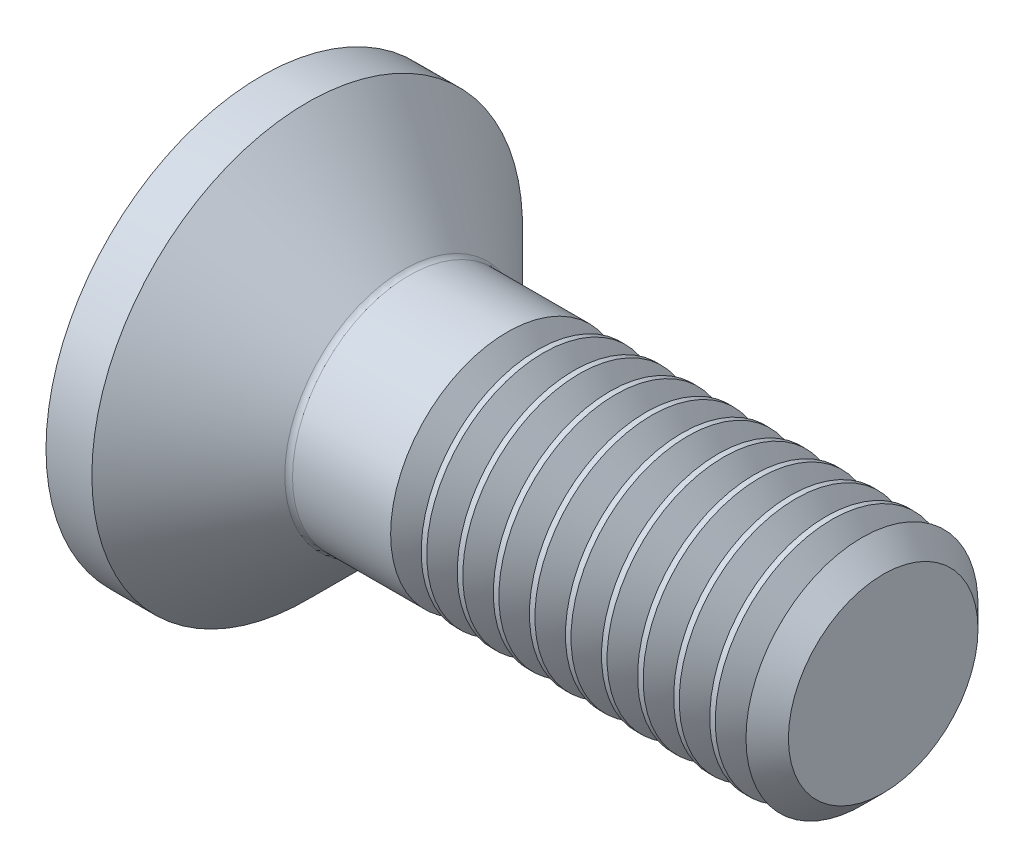
ISO-10303-21;
HEADER;
FILE_DESCRIPTION(('STEP AP214'),'2;1');
FILE_NAME('part.step','',(''),(''),'','','');
FILE_SCHEMA(('AUTOMOTIVE_DESIGN { 1 0 10303 214 1 1 1 1 }'));
ENDSEC;
DATA;
#1=APPLICATION_CONTEXT('core data for automotive mechanical design processes');
#2=APPLICATION_PROTOCOL_DEFINITION('international standard','automotive_design',2000,#1);
#3=PRODUCT_CONTEXT('',#1,'mechanical');
#4=PRODUCT('Part','Part','',(#3));
#5=PRODUCT_RELATED_PRODUCT_CATEGORY('part','',(#4));
#6=PRODUCT_DEFINITION_FORMATION('','',#4);
#7=PRODUCT_DEFINITION_CONTEXT('part definition',#1,'design');
#8=PRODUCT_DEFINITION('design','',#6,#7);
#9=PRODUCT_DEFINITION_SHAPE('','',#8);
#10=(LENGTH_UNIT() NAMED_UNIT(*) SI_UNIT(.MILLI.,.METRE.));
#11=(NAMED_UNIT(*) PLANE_ANGLE_UNIT() SI_UNIT($,.RADIAN.));
#12=(NAMED_UNIT(*) SI_UNIT($,.STERADIAN.) SOLID_ANGLE_UNIT());
#13=UNCERTAINTY_MEASURE_WITH_UNIT(LENGTH_MEASURE(1.E-05),#10,'distance_accuracy_value','');
#14=(GEOMETRIC_REPRESENTATION_CONTEXT(3) GLOBAL_UNCERTAINTY_ASSIGNED_CONTEXT((#13)) GLOBAL_UNIT_ASSIGNED_CONTEXT((#10,
#11,#12)) REPRESENTATION_CONTEXT('',''));
#15=CARTESIAN_POINT('',(0.,0.,0.));
#16=DIRECTION('',(0.,0.,1.));
#17=DIRECTION('',(1.,0.,0.));
#18=AXIS2_PLACEMENT_3D('',#15,#16,#17);
#19=CARTESIAN_POINT('',(0.,0.,0.));
#20=DIRECTION('',(-1.,0.,0.));
#21=DIRECTION('',(0.,0.,1.));
#22=AXIS2_PLACEMENT_3D('',#19,#20,#21);
#23=PLANE('',#22);
#24=CARTESIAN_POINT('',(0.,0.,0.));
#25=DIRECTION('',(-1.,0.,0.));
#26=DIRECTION('',(0.,0.,1.));
#27=AXIS2_PLACEMENT_3D('',#24,#25,#26);
#28=CIRCLE('',#27,2.77);
#29=CARTESIAN_POINT('',(0.,0.,2.77));
#30=VERTEX_POINT('',#29);
#31=EDGE_CURVE('E151',#30,#30,#28,.T.);
#32=ORIENTED_EDGE('',*,*,#31,.T.);
#33=EDGE_LOOP('',(#32));
#34=FACE_BOUND('',#33,.T.);
#35=DIRECTION('',(0.,-0.499999999999998,-0.86602540378444));
#36=VECTOR('',#35,1.);
#37=CARTESIAN_POINT('',(0.,-0.577350269189626,1.));
#38=LINE('',#37,#36);
#39=CARTESIAN_POINT('',(0.,-0.577350269189626,1.));
#40=VERTEX_POINT('',#39);
#41=CARTESIAN_POINT('',(0.,-1.15470053837925,0.));
#42=VERTEX_POINT('',#41);
#43=EDGE_CURVE('E120',#40,#42,#38,.T.);
#44=ORIENTED_EDGE('',*,*,#43,.T.);
#45=DIRECTION('',(0.,0.499999999999999,-0.866025403784439));
#46=VECTOR('',#45,1.);
#47=CARTESIAN_POINT('',(0.,-1.15470053837925,0.));
#48=LINE('',#47,#46);
#49=CARTESIAN_POINT('',(0.,-0.577350269189625,-1.));
#50=VERTEX_POINT('',#49);
#51=EDGE_CURVE('E51',#42,#50,#48,.T.);
#52=ORIENTED_EDGE('',*,*,#51,.T.);
#53=DIRECTION('',(0.,1.,0.));
#54=VECTOR('',#53,1.);
#55=CARTESIAN_POINT('',(0.,-0.577350269189625,-1.));
#56=LINE('',#55,#54);
#57=CARTESIAN_POINT('',(0.,0.577350269189626,-1.));
#58=VERTEX_POINT('',#57);
#59=EDGE_CURVE('E131',#50,#58,#56,.T.);
#60=ORIENTED_EDGE('',*,*,#59,.T.);
#61=DIRECTION('',(0.,0.5,0.866025403784439));
#62=VECTOR('',#61,1.);
#63=CARTESIAN_POINT('',(0.,0.577350269189626,-1.));
#64=LINE('',#63,#62);
#65=CARTESIAN_POINT('',(0.,1.15470053837925,0.));
#66=VERTEX_POINT('',#65);
#67=EDGE_CURVE('E416',#58,#66,#64,.T.);
#68=ORIENTED_EDGE('',*,*,#67,.T.);
#69=DIRECTION('',(0.,-0.499999999999999,0.866025403784439));
#70=VECTOR('',#69,1.);
#71=CARTESIAN_POINT('',(0.,1.15470053837925,0.));
#72=LINE('',#71,#70);
#73=CARTESIAN_POINT('',(0.,0.577350269189626,0.999999999999999));
#74=VERTEX_POINT('',#73);
#75=EDGE_CURVE('E419',#66,#74,#72,.T.);
#76=ORIENTED_EDGE('',*,*,#75,.T.);
#77=DIRECTION('',(0.,-1.,0.));
#78=VECTOR('',#77,1.);
#79=CARTESIAN_POINT('',(0.,0.577350269189626,0.999999999999999));
#80=LINE('',#79,#78);
#81=EDGE_CURVE('E422',#74,#40,#80,.T.);
#82=ORIENTED_EDGE('',*,*,#81,.T.);
#83=EDGE_LOOP('',(#44,#52,#60,#68,#76,#82));
#84=FACE_BOUND('',#83,.T.);
#85=ADVANCED_FACE('F35',(#34,#84),#23,.T.);
#86=CARTESIAN_POINT('',(0.,0.,0.));
#87=DIRECTION('',(-1.,0.,0.));
#88=DIRECTION('',(0.,0.,1.));
#89=AXIS2_PLACEMENT_3D('',#86,#87,#88);
#90=CYLINDRICAL_SURFACE('',#89,2.77);
#91=CARTESIAN_POINT('',(0.590000000000013,0.,0.));
#92=DIRECTION('',(-1.,0.,0.));
#93=DIRECTION('',(0.,0.,1.));
#94=AXIS2_PLACEMENT_3D('',#91,#92,#93);
#95=CIRCLE('',#94,2.77);
#96=CARTESIAN_POINT('',(0.590000000000013,0.,2.77));
#97=VERTEX_POINT('',#96);
#98=EDGE_CURVE('E148',#97,#97,#95,.T.);
#99=ORIENTED_EDGE('',*,*,#98,.T.);
#100=EDGE_LOOP('',(#99));
#101=FACE_BOUND('',#100,.T.);
#102=ORIENTED_EDGE('',*,*,#31,.F.);
#103=EDGE_LOOP('',(#102));
#104=FACE_BOUND('',#103,.T.);
#105=ADVANCED_FACE('F174',(#101,#104),#90,.T.);
#106=CARTESIAN_POINT('',(0.590000000000013,0.,0.));
#107=DIRECTION('',(-1.,0.,0.));
#108=DIRECTION('',(0.,0.,1.));
#109=AXIS2_PLACEMENT_3D('',#106,#107,#108);
#110=CONICAL_SURFACE('',#109,2.77,0.785398163397451);
#111=CARTESIAN_POINT('',(1.83071067811866,0.,0.));
#112=DIRECTION('',(-1.,0.,0.));
#113=DIRECTION('',(0.,0.,1.));
#114=AXIS2_PLACEMENT_3D('',#111,#112,#113);
#115=CIRCLE('',#114,1.52928932188135);
#116=CARTESIAN_POINT('',(1.83071067811866,0.,1.52928932188135));
#117=VERTEX_POINT('',#116);
#118=EDGE_CURVE('E44',#117,#117,#115,.T.);
#119=ORIENTED_EDGE('',*,*,#118,.T.);
#120=EDGE_LOOP('',(#119));
#121=FACE_BOUND('',#120,.T.);
#122=ORIENTED_EDGE('',*,*,#98,.F.);
#123=EDGE_LOOP('',(#122));
#124=FACE_BOUND('',#123,.T.);
#125=ADVANCED_FACE('F157',(#121,#124),#110,.T.);
#126=CARTESIAN_POINT('',(0.,0.,0.));
#127=DIRECTION('',(-1.,0.,0.));
#128=DIRECTION('',(0.,0.,1.));
#129=AXIS2_PLACEMENT_3D('',#126,#127,#128);
#130=CYLINDRICAL_SURFACE('',#129,1.5);
#131=CARTESIAN_POINT('',(3.16359278553217,0.,0.));
#132=DIRECTION('',(-1.,0.,0.));
#133=DIRECTION('',(0.,-1.,0.));
#134=AXIS2_PLACEMENT_3D('',#131,#132,#133);
#135=CIRCLE('',#134,1.5);
#136=CARTESIAN_POINT('',(3.16359278553217,-1.5,0.));
#137=VERTEX_POINT('',#136);
#138=EDGE_CURVE('E392',#137,#137,#135,.T.);
#139=ORIENTED_EDGE('',*,*,#138,.T.);
#140=EDGE_LOOP('',(#139));
#141=FACE_BOUND('',#140,.T.);
#142=CARTESIAN_POINT('',(1.90142135623731,0.,0.));
#143=DIRECTION('',(-1.,0.,0.));
#144=DIRECTION('',(0.,0.,1.));
#145=AXIS2_PLACEMENT_3D('',#142,#143,#144);
#146=CIRCLE('',#145,1.5);
#147=CARTESIAN_POINT('',(1.90142135623731,0.,1.5));
#148=VERTEX_POINT('',#147);
#149=EDGE_CURVE('E11',#148,#148,#146,.F.);
#150=ORIENTED_EDGE('',*,*,#149,.T.);
#151=EDGE_LOOP('',(#150));
#152=FACE_BOUND('',#151,.T.);
#153=ADVANCED_FACE('F161',(#141,#152),#130,.T.);
#154=CARTESIAN_POINT('',(1.90142135623731,0.,0.));
#155=DIRECTION('',(-1.,0.,0.));
#156=DIRECTION('',(0.,0.,1.));
#157=AXIS2_PLACEMENT_3D('',#154,#155,#156);
#158=TOROIDAL_SURFACE('',#157,1.6,0.1);
#159=ORIENTED_EDGE('',*,*,#149,.F.);
#160=EDGE_LOOP('',(#159));
#161=FACE_BOUND('',#160,.T.);
#162=ORIENTED_EDGE('',*,*,#118,.F.);
#163=EDGE_LOOP('',(#162));
#164=FACE_BOUND('',#163,.T.);
#165=ADVANCED_FACE('F37',(#161,#164),#158,.F.);
#166=CARTESIAN_POINT('',(1.1,-1.15470053837925,0.));
#167=DIRECTION('',(0.,0.866025403784439,0.499999999999999));
#168=DIRECTION('',(0.,-0.499999999999999,0.866025403784439));
#169=AXIS2_PLACEMENT_3D('',#166,#167,#168);
#170=PLANE('',#169);
#171=ORIENTED_EDGE('',*,*,#51,.F.);
#172=DIRECTION('',(-1.,0.,0.));
#173=VECTOR('',#172,1.);
#174=CARTESIAN_POINT('',(1.1,-1.15470053837925,0.));
#175=LINE('',#174,#173);
#176=CARTESIAN_POINT('',(1.1,-1.15470053837925,0.));
#177=VERTEX_POINT('',#176);
#178=EDGE_CURVE('E413',#177,#42,#175,.T.);
#179=ORIENTED_EDGE('',*,*,#178,.F.);
#180=DIRECTION('',(0.,0.499999999999999,-0.866025403784439));
#181=VECTOR('',#180,1.);
#182=CARTESIAN_POINT('',(1.1,-1.15470053837925,0.));
#183=LINE('',#182,#181);
#184=CARTESIAN_POINT('',(1.1,-0.866025403784438,-0.499999999999998));
#185=VERTEX_POINT('',#184);
#186=EDGE_CURVE('E116',#177,#185,#183,.T.);
#187=ORIENTED_EDGE('',*,*,#186,.T.);
#188=CARTESIAN_POINT('',(1.1,-0.577350269189625,-1.));
#189=VERTEX_POINT('',#188);
#190=EDGE_CURVE('E112',#185,#189,#183,.T.);
#191=ORIENTED_EDGE('',*,*,#190,.T.);
#192=DIRECTION('',(-1.,0.,0.));
#193=VECTOR('',#192,1.);
#194=CARTESIAN_POINT('',(1.1,-0.577350269189625,-1.));
#195=LINE('',#194,#193);
#196=EDGE_CURVE('E114',#189,#50,#195,.T.);
#197=ORIENTED_EDGE('',*,*,#196,.T.);
#198=EDGE_LOOP('',(#171,#179,#187,#191,#197));
#199=FACE_BOUND('',#198,.T.);
#200=ADVANCED_FACE('F113',(#199),#170,.T.);
#201=CARTESIAN_POINT('',(1.1,-0.577350269189625,-1.));
#202=DIRECTION('',(0.,0.,1.));
#203=DIRECTION('',(1.,0.,0.));
#204=AXIS2_PLACEMENT_3D('',#201,#202,#203);
#205=PLANE('',#204);
#206=ORIENTED_EDGE('',*,*,#59,.F.);
#207=ORIENTED_EDGE('',*,*,#196,.F.);
#208=DIRECTION('',(0.,1.,0.));
#209=VECTOR('',#208,1.);
#210=CARTESIAN_POINT('',(1.1,-0.577350269189625,-1.));
#211=LINE('',#210,#209);
#212=CARTESIAN_POINT('',(1.1,0.,-1.));
#213=VERTEX_POINT('',#212);
#214=EDGE_CURVE('E59',#189,#213,#211,.T.);
#215=ORIENTED_EDGE('',*,*,#214,.T.);
#216=CARTESIAN_POINT('',(1.1,0.577350269189626,-1.));
#217=VERTEX_POINT('',#216);
#218=EDGE_CURVE('E126',#213,#217,#211,.T.);
#219=ORIENTED_EDGE('',*,*,#218,.T.);
#220=DIRECTION('',(-1.,0.,0.));
#221=VECTOR('',#220,1.);
#222=CARTESIAN_POINT('',(1.1,0.577350269189626,-1.));
#223=LINE('',#222,#221);
#224=EDGE_CURVE('E133',#217,#58,#223,.T.);
#225=ORIENTED_EDGE('',*,*,#224,.T.);
#226=EDGE_LOOP('',(#206,#207,#215,#219,#225));
#227=FACE_BOUND('',#226,.T.);
#228=ADVANCED_FACE('F128',(#227),#205,.T.);
#229=CARTESIAN_POINT('',(1.1,0.577350269189626,-1.));
#230=DIRECTION('',(0.,-0.866025403784438,0.5));
#231=DIRECTION('',(0.,-0.5,-0.866025403784439));
#232=AXIS2_PLACEMENT_3D('',#229,#230,#231);
#233=PLANE('',#232);
#234=ORIENTED_EDGE('',*,*,#67,.F.);
#235=ORIENTED_EDGE('',*,*,#224,.F.);
#236=DIRECTION('',(0.,0.5,0.866025403784439));
#237=VECTOR('',#236,1.);
#238=CARTESIAN_POINT('',(1.1,0.577350269189626,-1.));
#239=LINE('',#238,#237);
#240=CARTESIAN_POINT('',(1.1,0.866025403784439,-0.5));
#241=VERTEX_POINT('',#240);
#242=EDGE_CURVE('E398',#217,#241,#239,.T.);
#243=ORIENTED_EDGE('',*,*,#242,.T.);
#244=CARTESIAN_POINT('',(1.1,1.15470053837925,0.));
#245=VERTEX_POINT('',#244);
#246=EDGE_CURVE('E125',#241,#245,#239,.T.);
#247=ORIENTED_EDGE('',*,*,#246,.T.);
#248=DIRECTION('',(-1.,0.,0.));
#249=VECTOR('',#248,1.);
#250=CARTESIAN_POINT('',(1.1,1.15470053837925,0.));
#251=LINE('',#250,#249);
#252=EDGE_CURVE('E139',#245,#66,#251,.T.);
#253=ORIENTED_EDGE('',*,*,#252,.T.);
#254=EDGE_LOOP('',(#234,#235,#243,#247,#253));
#255=FACE_BOUND('',#254,.T.);
#256=ADVANCED_FACE('F202',(#255),#233,.T.);
#257=CARTESIAN_POINT('',(1.1,1.15470053837925,0.));
#258=DIRECTION('',(0.,-0.866025403784439,-0.499999999999999));
#259=DIRECTION('',(0.,0.499999999999999,-0.866025403784439));
#260=AXIS2_PLACEMENT_3D('',#257,#258,#259);
#261=PLANE('',#260);
#262=ORIENTED_EDGE('',*,*,#75,.F.);
#263=ORIENTED_EDGE('',*,*,#252,.F.);
#264=DIRECTION('',(0.,-0.499999999999999,0.866025403784439));
#265=VECTOR('',#264,1.);
#266=CARTESIAN_POINT('',(1.1,1.15470053837925,0.));
#267=LINE('',#266,#265);
#268=CARTESIAN_POINT('',(1.1,0.866025403784438,0.499999999999999));
#269=VERTEX_POINT('',#268);
#270=EDGE_CURVE('E402',#245,#269,#267,.T.);
#271=ORIENTED_EDGE('',*,*,#270,.T.);
#272=CARTESIAN_POINT('',(1.1,0.577350269189626,0.999999999999999));
#273=VERTEX_POINT('',#272);
#274=EDGE_CURVE('E401',#269,#273,#267,.T.);
#275=ORIENTED_EDGE('',*,*,#274,.T.);
#276=DIRECTION('',(-1.,0.,0.));
#277=VECTOR('',#276,1.);
#278=CARTESIAN_POINT('',(1.1,0.577350269189626,0.999999999999999));
#279=LINE('',#278,#277);
#280=EDGE_CURVE('E431',#273,#74,#279,.T.);
#281=ORIENTED_EDGE('',*,*,#280,.T.);
#282=EDGE_LOOP('',(#262,#263,#271,#275,#281));
#283=FACE_BOUND('',#282,.T.);
#284=ADVANCED_FACE('F205',(#283),#261,.T.);
#285=CARTESIAN_POINT('',(1.1,0.577350269189626,0.999999999999999));
#286=DIRECTION('',(0.,0.,-1.));
#287=DIRECTION('',(0.,1.,0.));
#288=AXIS2_PLACEMENT_3D('',#285,#286,#287);
#289=PLANE('',#288);
#290=ORIENTED_EDGE('',*,*,#81,.F.);
#291=ORIENTED_EDGE('',*,*,#280,.F.);
#292=DIRECTION('',(0.,-1.,0.));
#293=VECTOR('',#292,1.);
#294=CARTESIAN_POINT('',(1.1,0.577350269189626,0.999999999999999));
#295=LINE('',#294,#293);
#296=CARTESIAN_POINT('',(1.1,0.,1.));
#297=VERTEX_POINT('',#296);
#298=EDGE_CURVE('E406',#273,#297,#295,.T.);
#299=ORIENTED_EDGE('',*,*,#298,.T.);
#300=CARTESIAN_POINT('',(1.1,-0.577350269189626,1.));
#301=VERTEX_POINT('',#300);
#302=EDGE_CURVE('E405',#297,#301,#295,.T.);
#303=ORIENTED_EDGE('',*,*,#302,.T.);
#304=DIRECTION('',(-1.,0.,0.));
#305=VECTOR('',#304,1.);
#306=CARTESIAN_POINT('',(1.1,-0.577350269189626,1.));
#307=LINE('',#306,#305);
#308=EDGE_CURVE('E428',#301,#40,#307,.T.);
#309=ORIENTED_EDGE('',*,*,#308,.T.);
#310=EDGE_LOOP('',(#290,#291,#299,#303,#309));
#311=FACE_BOUND('',#310,.T.);
#312=ADVANCED_FACE('F209',(#311),#289,.T.);
#313=CARTESIAN_POINT('',(1.1,-0.577350269189626,1.));
#314=DIRECTION('',(0.,0.86602540378444,-0.499999999999998));
#315=DIRECTION('',(0.,0.499999999999998,0.86602540378444));
#316=AXIS2_PLACEMENT_3D('',#313,#314,#315);
#317=PLANE('',#316);
#318=ORIENTED_EDGE('',*,*,#43,.F.);
#319=ORIENTED_EDGE('',*,*,#308,.F.);
#320=DIRECTION('',(0.,-0.499999999999998,-0.86602540378444));
#321=VECTOR('',#320,1.);
#322=CARTESIAN_POINT('',(1.1,-0.577350269189626,1.));
#323=LINE('',#322,#321);
#324=CARTESIAN_POINT('',(1.1,-0.866025403784439,0.499999999999997));
#325=VERTEX_POINT('',#324);
#326=EDGE_CURVE('E410',#301,#325,#323,.T.);
#327=ORIENTED_EDGE('',*,*,#326,.T.);
#328=EDGE_CURVE('E409',#325,#177,#323,.T.);
#329=ORIENTED_EDGE('',*,*,#328,.T.);
#330=ORIENTED_EDGE('',*,*,#178,.T.);
#331=EDGE_LOOP('',(#318,#319,#327,#329,#330));
#332=FACE_BOUND('',#331,.T.);
#333=ADVANCED_FACE('F213',(#332),#317,.T.);
#334=CARTESIAN_POINT('',(1.1,-0.577350269189626,-1.));
#335=DIRECTION('',(1.,0.,0.));
#336=DIRECTION('',(0.,0.,-1.));
#337=AXIS2_PLACEMENT_3D('',#334,#335,#336);
#338=PLANE('',#337);
#339=ORIENTED_EDGE('',*,*,#214,.F.);
#340=ORIENTED_EDGE('',*,*,#190,.F.);
#341=CARTESIAN_POINT('',(1.1,0.,0.));
#342=DIRECTION('',(-1.,0.,0.));
#343=DIRECTION('',(0.,0.,1.));
#344=AXIS2_PLACEMENT_3D('',#341,#342,#343);
#345=CIRCLE('',#344,1.);
#346=EDGE_CURVE('E123',#213,#185,#345,.T.);
#347=ORIENTED_EDGE('',*,*,#346,.F.);
#348=EDGE_LOOP('',(#339,#340,#347));
#349=FACE_BOUND('',#348,.T.);
#350=ADVANCED_FACE('F122',(#349),#338,.F.);
#351=ORIENTED_EDGE('',*,*,#186,.F.);
#352=ORIENTED_EDGE('',*,*,#328,.F.);
#353=EDGE_CURVE('E136',#185,#325,#345,.T.);
#354=ORIENTED_EDGE('',*,*,#353,.F.);
#355=EDGE_LOOP('',(#351,#352,#354));
#356=FACE_BOUND('',#355,.T.);
#357=ADVANCED_FACE('F220',(#356),#338,.F.);
#358=ORIENTED_EDGE('',*,*,#326,.F.);
#359=ORIENTED_EDGE('',*,*,#302,.F.);
#360=EDGE_CURVE('E132',#325,#297,#345,.T.);
#361=ORIENTED_EDGE('',*,*,#360,.F.);
#362=EDGE_LOOP('',(#358,#359,#361));
#363=FACE_BOUND('',#362,.T.);
#364=ADVANCED_FACE('F444',(#363),#338,.F.);
#365=ORIENTED_EDGE('',*,*,#298,.F.);
#366=ORIENTED_EDGE('',*,*,#274,.F.);
#367=EDGE_CURVE('E138',#297,#269,#345,.T.);
#368=ORIENTED_EDGE('',*,*,#367,.F.);
#369=EDGE_LOOP('',(#365,#366,#368));
#370=FACE_BOUND('',#369,.T.);
#371=ADVANCED_FACE('F455',(#370),#338,.F.);
#372=ORIENTED_EDGE('',*,*,#270,.F.);
#373=ORIENTED_EDGE('',*,*,#246,.F.);
#374=EDGE_CURVE('E145',#269,#241,#345,.T.);
#375=ORIENTED_EDGE('',*,*,#374,.F.);
#376=EDGE_LOOP('',(#372,#373,#375));
#377=FACE_BOUND('',#376,.T.);
#378=ADVANCED_FACE('F453',(#377),#338,.F.);
#379=ORIENTED_EDGE('',*,*,#242,.F.);
#380=ORIENTED_EDGE('',*,*,#218,.F.);
#381=EDGE_CURVE('E449',#241,#213,#345,.T.);
#382=ORIENTED_EDGE('',*,*,#381,.F.);
#383=EDGE_LOOP('',(#379,#380,#382));
#384=FACE_BOUND('',#383,.T.);
#385=ADVANCED_FACE('F197',(#384),#338,.F.);
#386=CARTESIAN_POINT('',(1.1,0.,0.));
#387=DIRECTION('',(-1.,0.,0.));
#388=DIRECTION('',(0.,0.,1.));
#389=AXIS2_PLACEMENT_3D('',#386,#387,#388);
#390=CONICAL_SURFACE('',#389,1.,1.04719755119659);
#391=CARTESIAN_POINT('',(1.67735026918963,0.,0.));
#392=VERTEX_POINT('',#391);
#393=VERTEX_LOOP('',#392);
#394=FACE_BOUND('',#393,.T.);
#395=ORIENTED_EDGE('',*,*,#367,.T.);
#396=ORIENTED_EDGE('',*,*,#374,.T.);
#397=ORIENTED_EDGE('',*,*,#381,.T.);
#398=ORIENTED_EDGE('',*,*,#346,.T.);
#399=ORIENTED_EDGE('',*,*,#353,.T.);
#400=ORIENTED_EDGE('',*,*,#360,.T.);
#401=EDGE_LOOP('',(#395,#396,#397,#398,#399,#400));
#402=FACE_BOUND('',#401,.T.);
#403=ADVANCED_FACE('F194',(#394,#402),#390,.F.);
#404=CARTESIAN_POINT('',(3.55640921446782,0.,0.));
#405=DIRECTION('',(1.,0.,0.));
#406=DIRECTION('',(0.,1.,0.));
#407=AXIS2_PLACEMENT_3D('',#404,#405,#406);
#408=CONICAL_SURFACE('',#407,1.5,0.959931088596882);
#409=CARTESIAN_POINT('',(3.360001,0.,0.));
#410=DIRECTION('',(-1.,0.,0.));
#411=DIRECTION('',(0.,-1.,0.));
#412=AXIS2_PLACEMENT_3D('',#409,#410,#411);
#413=CIRCLE('',#412,1.2195);
#414=CARTESIAN_POINT('',(3.360001,-1.2195,0.));
#415=VERTEX_POINT('',#414);
#416=EDGE_CURVE('E389',#415,#415,#413,.T.);
#417=ORIENTED_EDGE('',*,*,#416,.F.);
#418=EDGE_LOOP('',(#417));
#419=FACE_BOUND('',#418,.T.);
#420=CARTESIAN_POINT('',(3.55640921446782,0.,0.));
#421=DIRECTION('',(-1.,0.,0.));
#422=DIRECTION('',(0.,-1.,0.));
#423=AXIS2_PLACEMENT_3D('',#420,#421,#422);
#424=CIRCLE('',#423,1.5);
#425=CARTESIAN_POINT('',(3.55640921446782,-1.5,0.));
#426=VERTEX_POINT('',#425);
#427=EDGE_CURVE('E395',#426,#426,#424,.T.);
#428=ORIENTED_EDGE('',*,*,#427,.T.);
#429=EDGE_LOOP('',(#428));
#430=FACE_BOUND('',#429,.T.);
#431=ADVANCED_FACE('F196',(#419,#430),#408,.T.);
#432=CARTESIAN_POINT('',(3.360001,0.,0.));
#433=DIRECTION('',(-1.,0.,0.));
#434=DIRECTION('',(0.,-1.,0.));
#435=AXIS2_PLACEMENT_3D('',#432,#433,#434);
#436=CONICAL_SURFACE('',#435,1.2195,0.959931088596878);
#437=ORIENTED_EDGE('',*,*,#138,.F.);
#438=EDGE_LOOP('',(#437));
#439=FACE_BOUND('',#438,.T.);
#440=ORIENTED_EDGE('',*,*,#416,.T.);
#441=EDGE_LOOP('',(#440));
#442=FACE_BOUND('',#441,.T.);
#443=ADVANCED_FACE('F223',(#439,#442),#436,.T.);
#444=CARTESIAN_POINT('',(3.62759278553217,0.,0.));
#445=DIRECTION('',(-1.,0.,0.));
#446=DIRECTION('',(0.,-1.,0.));
#447=AXIS2_PLACEMENT_3D('',#444,#445,#446);
#448=CIRCLE('',#447,1.5);
#449=CARTESIAN_POINT('',(3.62759278553217,-1.5,0.));
#450=VERTEX_POINT('',#449);
#451=EDGE_CURVE('E383',#450,#450,#448,.T.);
#452=ORIENTED_EDGE('',*,*,#451,.T.);
#453=EDGE_LOOP('',(#452));
#454=FACE_BOUND('',#453,.T.);
#455=ORIENTED_EDGE('',*,*,#427,.F.);
#456=EDGE_LOOP('',(#455));
#457=FACE_BOUND('',#456,.T.);
#458=ADVANCED_FACE('F171',(#454,#457),#130,.T.);
#459=CARTESIAN_POINT('',(4.02040921446782,0.,0.));
#460=DIRECTION('',(1.,0.,0.));
#461=DIRECTION('',(0.,1.,0.));
#462=AXIS2_PLACEMENT_3D('',#459,#460,#461);
#463=CONICAL_SURFACE('',#462,1.5,0.959931088596882);
#464=CARTESIAN_POINT('',(3.824001,0.,0.));
#465=DIRECTION('',(-1.,0.,0.));
#466=DIRECTION('',(0.,-1.,0.));
#467=AXIS2_PLACEMENT_3D('',#464,#465,#466);
#468=CIRCLE('',#467,1.2195);
#469=CARTESIAN_POINT('',(3.824001,-1.2195,0.));
#470=VERTEX_POINT('',#469);
#471=EDGE_CURVE('E380',#470,#470,#468,.T.);
#472=ORIENTED_EDGE('',*,*,#471,.F.);
#473=EDGE_LOOP('',(#472));
#474=FACE_BOUND('',#473,.T.);
#475=CARTESIAN_POINT('',(4.02040921446782,0.,0.));
#476=DIRECTION('',(-1.,0.,0.));
#477=DIRECTION('',(0.,-1.,0.));
#478=AXIS2_PLACEMENT_3D('',#475,#476,#477);
#479=CIRCLE('',#478,1.5);
#480=CARTESIAN_POINT('',(4.02040921446782,-1.5,0.));
#481=VERTEX_POINT('',#480);
#482=EDGE_CURVE('E386',#481,#481,#479,.T.);
#483=ORIENTED_EDGE('',*,*,#482,.T.);
#484=EDGE_LOOP('',(#483));
#485=FACE_BOUND('',#484,.T.);
#486=ADVANCED_FACE('F228',(#474,#485),#463,.T.);
#487=CARTESIAN_POINT('',(3.824001,0.,0.));
#488=DIRECTION('',(-1.,0.,0.));
#489=DIRECTION('',(0.,-1.,0.));
#490=AXIS2_PLACEMENT_3D('',#487,#488,#489);
#491=CONICAL_SURFACE('',#490,1.2195,0.959931088596878);
#492=ORIENTED_EDGE('',*,*,#451,.F.);
#493=EDGE_LOOP('',(#492));
#494=FACE_BOUND('',#493,.T.);
#495=ORIENTED_EDGE('',*,*,#471,.T.);
#496=EDGE_LOOP('',(#495));
#497=FACE_BOUND('',#496,.T.);
#498=ADVANCED_FACE('F231',(#494,#497),#491,.T.);
#499=CARTESIAN_POINT('',(4.09159278553217,0.,0.));
#500=DIRECTION('',(-1.,0.,0.));
#501=DIRECTION('',(0.,-1.,0.));
#502=AXIS2_PLACEMENT_3D('',#499,#500,#501);
#503=CIRCLE('',#502,1.5);
#504=CARTESIAN_POINT('',(4.09159278553217,-1.5,0.));
#505=VERTEX_POINT('',#504);
#506=EDGE_CURVE('E374',#505,#505,#503,.T.);
#507=ORIENTED_EDGE('',*,*,#506,.T.);
#508=EDGE_LOOP('',(#507));
#509=FACE_BOUND('',#508,.T.);
#510=ORIENTED_EDGE('',*,*,#482,.F.);
#511=EDGE_LOOP('',(#510));
#512=FACE_BOUND('',#511,.T.);
#513=ADVANCED_FACE('F235',(#509,#512),#130,.T.);
#514=CARTESIAN_POINT('',(4.48440921446782,0.,0.));
#515=DIRECTION('',(1.,0.,0.));
#516=DIRECTION('',(0.,1.,0.));
#517=AXIS2_PLACEMENT_3D('',#514,#515,#516);
#518=CONICAL_SURFACE('',#517,1.5,0.959931088596882);
#519=CARTESIAN_POINT('',(4.288001,0.,0.));
#520=DIRECTION('',(-1.,0.,0.));
#521=DIRECTION('',(0.,-1.,0.));
#522=AXIS2_PLACEMENT_3D('',#519,#520,#521);
#523=CIRCLE('',#522,1.2195);
#524=CARTESIAN_POINT('',(4.288001,-1.2195,0.));
#525=VERTEX_POINT('',#524);
#526=EDGE_CURVE('E371',#525,#525,#523,.T.);
#527=ORIENTED_EDGE('',*,*,#526,.F.);
#528=EDGE_LOOP('',(#527));
#529=FACE_BOUND('',#528,.T.);
#530=CARTESIAN_POINT('',(4.48440921446782,0.,0.));
#531=DIRECTION('',(-1.,0.,0.));
#532=DIRECTION('',(0.,-1.,0.));
#533=AXIS2_PLACEMENT_3D('',#530,#531,#532);
#534=CIRCLE('',#533,1.5);
#535=CARTESIAN_POINT('',(4.48440921446782,-1.5,0.));
#536=VERTEX_POINT('',#535);
#537=EDGE_CURVE('E377',#536,#536,#534,.T.);
#538=ORIENTED_EDGE('',*,*,#537,.T.);
#539=EDGE_LOOP('',(#538));
#540=FACE_BOUND('',#539,.T.);
#541=ADVANCED_FACE('F237',(#529,#540),#518,.T.);
#542=CARTESIAN_POINT('',(4.288001,0.,0.));
#543=DIRECTION('',(-1.,0.,0.));
#544=DIRECTION('',(0.,-1.,0.));
#545=AXIS2_PLACEMENT_3D('',#542,#543,#544);
#546=CONICAL_SURFACE('',#545,1.2195,0.959931088596878);
#547=ORIENTED_EDGE('',*,*,#506,.F.);
#548=EDGE_LOOP('',(#547));
#549=FACE_BOUND('',#548,.T.);
#550=ORIENTED_EDGE('',*,*,#526,.T.);
#551=EDGE_LOOP('',(#550));
#552=FACE_BOUND('',#551,.T.);
#553=ADVANCED_FACE('F240',(#549,#552),#546,.T.);
#554=CARTESIAN_POINT('',(4.55559278553217,0.,0.));
#555=DIRECTION('',(-1.,0.,0.));
#556=DIRECTION('',(0.,-1.,0.));
#557=AXIS2_PLACEMENT_3D('',#554,#555,#556);
#558=CIRCLE('',#557,1.5);
#559=CARTESIAN_POINT('',(4.55559278553217,-1.5,0.));
#560=VERTEX_POINT('',#559);
#561=EDGE_CURVE('E365',#560,#560,#558,.T.);
#562=ORIENTED_EDGE('',*,*,#561,.T.);
#563=EDGE_LOOP('',(#562));
#564=FACE_BOUND('',#563,.T.);
#565=ORIENTED_EDGE('',*,*,#537,.F.);
#566=EDGE_LOOP('',(#565));
#567=FACE_BOUND('',#566,.T.);
#568=ADVANCED_FACE('F244',(#564,#567),#130,.T.);
#569=CARTESIAN_POINT('',(4.94840921446782,0.,0.));
#570=DIRECTION('',(1.,0.,0.));
#571=DIRECTION('',(0.,1.,0.));
#572=AXIS2_PLACEMENT_3D('',#569,#570,#571);
#573=CONICAL_SURFACE('',#572,1.5,0.959931088596882);
#574=CARTESIAN_POINT('',(4.752001,0.,0.));
#575=DIRECTION('',(-1.,0.,0.));
#576=DIRECTION('',(0.,-1.,0.));
#577=AXIS2_PLACEMENT_3D('',#574,#575,#576);
#578=CIRCLE('',#577,1.2195);
#579=CARTESIAN_POINT('',(4.752001,-1.2195,0.));
#580=VERTEX_POINT('',#579);
#581=EDGE_CURVE('E362',#580,#580,#578,.T.);
#582=ORIENTED_EDGE('',*,*,#581,.F.);
#583=EDGE_LOOP('',(#582));
#584=FACE_BOUND('',#583,.T.);
#585=CARTESIAN_POINT('',(4.94840921446782,0.,0.));
#586=DIRECTION('',(-1.,0.,0.));
#587=DIRECTION('',(0.,-1.,0.));
#588=AXIS2_PLACEMENT_3D('',#585,#586,#587);
#589=CIRCLE('',#588,1.5);
#590=CARTESIAN_POINT('',(4.94840921446782,-1.5,0.));
#591=VERTEX_POINT('',#590);
#592=EDGE_CURVE('E368',#591,#591,#589,.T.);
#593=ORIENTED_EDGE('',*,*,#592,.T.);
#594=EDGE_LOOP('',(#593));
#595=FACE_BOUND('',#594,.T.);
#596=ADVANCED_FACE('F246',(#584,#595),#573,.T.);
#597=CARTESIAN_POINT('',(4.752001,0.,0.));
#598=DIRECTION('',(-1.,0.,0.));
#599=DIRECTION('',(0.,-1.,0.));
#600=AXIS2_PLACEMENT_3D('',#597,#598,#599);
#601=CONICAL_SURFACE('',#600,1.2195,0.959931088596878);
#602=ORIENTED_EDGE('',*,*,#561,.F.);
#603=EDGE_LOOP('',(#602));
#604=FACE_BOUND('',#603,.T.);
#605=ORIENTED_EDGE('',*,*,#581,.T.);
#606=EDGE_LOOP('',(#605));
#607=FACE_BOUND('',#606,.T.);
#608=ADVANCED_FACE('F249',(#604,#607),#601,.T.);
#609=CARTESIAN_POINT('',(5.01959278553217,0.,0.));
#610=DIRECTION('',(-1.,0.,0.));
#611=DIRECTION('',(0.,-1.,0.));
#612=AXIS2_PLACEMENT_3D('',#609,#610,#611);
#613=CIRCLE('',#612,1.5);
#614=CARTESIAN_POINT('',(5.01959278553217,-1.5,0.));
#615=VERTEX_POINT('',#614);
#616=EDGE_CURVE('E356',#615,#615,#613,.T.);
#617=ORIENTED_EDGE('',*,*,#616,.T.);
#618=EDGE_LOOP('',(#617));
#619=FACE_BOUND('',#618,.T.);
#620=ORIENTED_EDGE('',*,*,#592,.F.);
#621=EDGE_LOOP('',(#620));
#622=FACE_BOUND('',#621,.T.);
#623=ADVANCED_FACE('F253',(#619,#622),#130,.T.);
#624=CARTESIAN_POINT('',(5.41240921446782,0.,0.));
#625=DIRECTION('',(1.,0.,0.));
#626=DIRECTION('',(0.,1.,0.));
#627=AXIS2_PLACEMENT_3D('',#624,#625,#626);
#628=CONICAL_SURFACE('',#627,1.5,0.959931088596882);
#629=CARTESIAN_POINT('',(5.216001,0.,0.));
#630=DIRECTION('',(-1.,0.,0.));
#631=DIRECTION('',(0.,-1.,0.));
#632=AXIS2_PLACEMENT_3D('',#629,#630,#631);
#633=CIRCLE('',#632,1.2195);
#634=CARTESIAN_POINT('',(5.216001,-1.2195,0.));
#635=VERTEX_POINT('',#634);
#636=EDGE_CURVE('E353',#635,#635,#633,.T.);
#637=ORIENTED_EDGE('',*,*,#636,.F.);
#638=EDGE_LOOP('',(#637));
#639=FACE_BOUND('',#638,.T.);
#640=CARTESIAN_POINT('',(5.41240921446782,0.,0.));
#641=DIRECTION('',(-1.,0.,0.));
#642=DIRECTION('',(0.,-1.,0.));
#643=AXIS2_PLACEMENT_3D('',#640,#641,#642);
#644=CIRCLE('',#643,1.5);
#645=CARTESIAN_POINT('',(5.41240921446782,-1.5,0.));
#646=VERTEX_POINT('',#645);
#647=EDGE_CURVE('E359',#646,#646,#644,.T.);
#648=ORIENTED_EDGE('',*,*,#647,.T.);
#649=EDGE_LOOP('',(#648));
#650=FACE_BOUND('',#649,.T.);
#651=ADVANCED_FACE('F255',(#639,#650),#628,.T.);
#652=CARTESIAN_POINT('',(5.216001,0.,0.));
#653=DIRECTION('',(-1.,0.,0.));
#654=DIRECTION('',(0.,-1.,0.));
#655=AXIS2_PLACEMENT_3D('',#652,#653,#654);
#656=CONICAL_SURFACE('',#655,1.2195,0.959931088596878);
#657=ORIENTED_EDGE('',*,*,#616,.F.);
#658=EDGE_LOOP('',(#657));
#659=FACE_BOUND('',#658,.T.);
#660=ORIENTED_EDGE('',*,*,#636,.T.);
#661=EDGE_LOOP('',(#660));
#662=FACE_BOUND('',#661,.T.);
#663=ADVANCED_FACE('F258',(#659,#662),#656,.T.);
#664=CARTESIAN_POINT('',(5.48359278553217,0.,0.));
#665=DIRECTION('',(-1.,0.,0.));
#666=DIRECTION('',(0.,-1.,0.));
#667=AXIS2_PLACEMENT_3D('',#664,#665,#666);
#668=CIRCLE('',#667,1.5);
#669=CARTESIAN_POINT('',(5.48359278553217,-1.5,0.));
#670=VERTEX_POINT('',#669);
#671=EDGE_CURVE('E347',#670,#670,#668,.T.);
#672=ORIENTED_EDGE('',*,*,#671,.T.);
#673=EDGE_LOOP('',(#672));
#674=FACE_BOUND('',#673,.T.);
#675=ORIENTED_EDGE('',*,*,#647,.F.);
#676=EDGE_LOOP('',(#675));
#677=FACE_BOUND('',#676,.T.);
#678=ADVANCED_FACE('F262',(#674,#677),#130,.T.);
#679=CARTESIAN_POINT('',(5.87640921446782,0.,0.));
#680=DIRECTION('',(1.,0.,0.));
#681=DIRECTION('',(0.,1.,0.));
#682=AXIS2_PLACEMENT_3D('',#679,#680,#681);
#683=CONICAL_SURFACE('',#682,1.5,0.959931088596882);
#684=CARTESIAN_POINT('',(5.680001,0.,0.));
#685=DIRECTION('',(-1.,0.,0.));
#686=DIRECTION('',(0.,-1.,0.));
#687=AXIS2_PLACEMENT_3D('',#684,#685,#686);
#688=CIRCLE('',#687,1.2195);
#689=CARTESIAN_POINT('',(5.680001,-1.2195,0.));
#690=VERTEX_POINT('',#689);
#691=EDGE_CURVE('E344',#690,#690,#688,.T.);
#692=ORIENTED_EDGE('',*,*,#691,.F.);
#693=EDGE_LOOP('',(#692));
#694=FACE_BOUND('',#693,.T.);
#695=CARTESIAN_POINT('',(5.87640921446782,0.,0.));
#696=DIRECTION('',(-1.,0.,0.));
#697=DIRECTION('',(0.,-1.,0.));
#698=AXIS2_PLACEMENT_3D('',#695,#696,#697);
#699=CIRCLE('',#698,1.5);
#700=CARTESIAN_POINT('',(5.87640921446782,-1.5,0.));
#701=VERTEX_POINT('',#700);
#702=EDGE_CURVE('E350',#701,#701,#699,.T.);
#703=ORIENTED_EDGE('',*,*,#702,.T.);
#704=EDGE_LOOP('',(#703));
#705=FACE_BOUND('',#704,.T.);
#706=ADVANCED_FACE('F264',(#694,#705),#683,.T.);
#707=CARTESIAN_POINT('',(5.680001,0.,0.));
#708=DIRECTION('',(-1.,0.,0.));
#709=DIRECTION('',(0.,-1.,0.));
#710=AXIS2_PLACEMENT_3D('',#707,#708,#709);
#711=CONICAL_SURFACE('',#710,1.2195,0.959931088596878);
#712=ORIENTED_EDGE('',*,*,#671,.F.);
#713=EDGE_LOOP('',(#712));
#714=FACE_BOUND('',#713,.T.);
#715=ORIENTED_EDGE('',*,*,#691,.T.);
#716=EDGE_LOOP('',(#715));
#717=FACE_BOUND('',#716,.T.);
#718=ADVANCED_FACE('F267',(#714,#717),#711,.T.);
#719=CARTESIAN_POINT('',(5.94759278553217,0.,0.));
#720=DIRECTION('',(-1.,0.,0.));
#721=DIRECTION('',(0.,-1.,0.));
#722=AXIS2_PLACEMENT_3D('',#719,#720,#721);
#723=CIRCLE('',#722,1.5);
#724=CARTESIAN_POINT('',(5.94759278553217,-1.5,0.));
#725=VERTEX_POINT('',#724);
#726=EDGE_CURVE('E338',#725,#725,#723,.T.);
#727=ORIENTED_EDGE('',*,*,#726,.T.);
#728=EDGE_LOOP('',(#727));
#729=FACE_BOUND('',#728,.T.);
#730=ORIENTED_EDGE('',*,*,#702,.F.);
#731=EDGE_LOOP('',(#730));
#732=FACE_BOUND('',#731,.T.);
#733=ADVANCED_FACE('F271',(#729,#732),#130,.T.);
#734=CARTESIAN_POINT('',(6.34040921446782,0.,0.));
#735=DIRECTION('',(1.,0.,0.));
#736=DIRECTION('',(0.,1.,0.));
#737=AXIS2_PLACEMENT_3D('',#734,#735,#736);
#738=CONICAL_SURFACE('',#737,1.5,0.959931088596882);
#739=CARTESIAN_POINT('',(6.144001,0.,0.));
#740=DIRECTION('',(-1.,0.,0.));
#741=DIRECTION('',(0.,-1.,0.));
#742=AXIS2_PLACEMENT_3D('',#739,#740,#741);
#743=CIRCLE('',#742,1.2195);
#744=CARTESIAN_POINT('',(6.144001,-1.2195,0.));
#745=VERTEX_POINT('',#744);
#746=EDGE_CURVE('E335',#745,#745,#743,.T.);
#747=ORIENTED_EDGE('',*,*,#746,.F.);
#748=EDGE_LOOP('',(#747));
#749=FACE_BOUND('',#748,.T.);
#750=CARTESIAN_POINT('',(6.34040921446782,0.,0.));
#751=DIRECTION('',(-1.,0.,0.));
#752=DIRECTION('',(0.,-1.,0.));
#753=AXIS2_PLACEMENT_3D('',#750,#751,#752);
#754=CIRCLE('',#753,1.5);
#755=CARTESIAN_POINT('',(6.34040921446782,-1.5,0.));
#756=VERTEX_POINT('',#755);
#757=EDGE_CURVE('E341',#756,#756,#754,.T.);
#758=ORIENTED_EDGE('',*,*,#757,.T.);
#759=EDGE_LOOP('',(#758));
#760=FACE_BOUND('',#759,.T.);
#761=ADVANCED_FACE('F273',(#749,#760),#738,.T.);
#762=CARTESIAN_POINT('',(6.144001,0.,0.));
#763=DIRECTION('',(-1.,0.,0.));
#764=DIRECTION('',(0.,-1.,0.));
#765=AXIS2_PLACEMENT_3D('',#762,#763,#764);
#766=CONICAL_SURFACE('',#765,1.2195,0.959931088596878);
#767=ORIENTED_EDGE('',*,*,#726,.F.);
#768=EDGE_LOOP('',(#767));
#769=FACE_BOUND('',#768,.T.);
#770=ORIENTED_EDGE('',*,*,#746,.T.);
#771=EDGE_LOOP('',(#770));
#772=FACE_BOUND('',#771,.T.);
#773=ADVANCED_FACE('F276',(#769,#772),#766,.T.);
#774=CARTESIAN_POINT('',(6.41159278553217,0.,0.));
#775=DIRECTION('',(-1.,0.,0.));
#776=DIRECTION('',(0.,-1.,0.));
#777=AXIS2_PLACEMENT_3D('',#774,#775,#776);
#778=CIRCLE('',#777,1.5);
#779=CARTESIAN_POINT('',(6.41159278553217,-1.5,0.));
#780=VERTEX_POINT('',#779);
#781=EDGE_CURVE('E329',#780,#780,#778,.T.);
#782=ORIENTED_EDGE('',*,*,#781,.T.);
#783=EDGE_LOOP('',(#782));
#784=FACE_BOUND('',#783,.T.);
#785=ORIENTED_EDGE('',*,*,#757,.F.);
#786=EDGE_LOOP('',(#785));
#787=FACE_BOUND('',#786,.T.);
#788=ADVANCED_FACE('F280',(#784,#787),#130,.T.);
#789=CARTESIAN_POINT('',(6.80440921446782,0.,0.));
#790=DIRECTION('',(1.,0.,0.));
#791=DIRECTION('',(0.,1.,0.));
#792=AXIS2_PLACEMENT_3D('',#789,#790,#791);
#793=CONICAL_SURFACE('',#792,1.5,0.959931088596882);
#794=CARTESIAN_POINT('',(6.608001,0.,0.));
#795=DIRECTION('',(-1.,0.,0.));
#796=DIRECTION('',(0.,-1.,0.));
#797=AXIS2_PLACEMENT_3D('',#794,#795,#796);
#798=CIRCLE('',#797,1.2195);
#799=CARTESIAN_POINT('',(6.608001,-1.2195,0.));
#800=VERTEX_POINT('',#799);
#801=EDGE_CURVE('E326',#800,#800,#798,.T.);
#802=ORIENTED_EDGE('',*,*,#801,.F.);
#803=EDGE_LOOP('',(#802));
#804=FACE_BOUND('',#803,.T.);
#805=CARTESIAN_POINT('',(6.80440921446782,0.,0.));
#806=DIRECTION('',(-1.,0.,0.));
#807=DIRECTION('',(0.,-1.,0.));
#808=AXIS2_PLACEMENT_3D('',#805,#806,#807);
#809=CIRCLE('',#808,1.5);
#810=CARTESIAN_POINT('',(6.80440921446782,-1.5,0.));
#811=VERTEX_POINT('',#810);
#812=EDGE_CURVE('E332',#811,#811,#809,.T.);
#813=ORIENTED_EDGE('',*,*,#812,.T.);
#814=EDGE_LOOP('',(#813));
#815=FACE_BOUND('',#814,.T.);
#816=ADVANCED_FACE('F282',(#804,#815),#793,.T.);
#817=CARTESIAN_POINT('',(6.608001,0.,0.));
#818=DIRECTION('',(-1.,0.,0.));
#819=DIRECTION('',(0.,-1.,0.));
#820=AXIS2_PLACEMENT_3D('',#817,#818,#819);
#821=CONICAL_SURFACE('',#820,1.2195,0.959931088596878);
#822=ORIENTED_EDGE('',*,*,#781,.F.);
#823=EDGE_LOOP('',(#822));
#824=FACE_BOUND('',#823,.T.);
#825=ORIENTED_EDGE('',*,*,#801,.T.);
#826=EDGE_LOOP('',(#825));
#827=FACE_BOUND('',#826,.T.);
#828=ADVANCED_FACE('F285',(#824,#827),#821,.T.);
#829=CARTESIAN_POINT('',(6.87559278553217,0.,0.));
#830=DIRECTION('',(-1.,0.,0.));
#831=DIRECTION('',(0.,-1.,0.));
#832=AXIS2_PLACEMENT_3D('',#829,#830,#831);
#833=CIRCLE('',#832,1.5);
#834=CARTESIAN_POINT('',(6.87559278553217,-1.5,0.));
#835=VERTEX_POINT('',#834);
#836=EDGE_CURVE('E320',#835,#835,#833,.T.);
#837=ORIENTED_EDGE('',*,*,#836,.T.);
#838=EDGE_LOOP('',(#837));
#839=FACE_BOUND('',#838,.T.);
#840=ORIENTED_EDGE('',*,*,#812,.F.);
#841=EDGE_LOOP('',(#840));
#842=FACE_BOUND('',#841,.T.);
#843=ADVANCED_FACE('F289',(#839,#842),#130,.T.);
#844=CARTESIAN_POINT('',(7.26840921446782,0.,0.));
#845=DIRECTION('',(1.,0.,0.));
#846=DIRECTION('',(0.,1.,0.));
#847=AXIS2_PLACEMENT_3D('',#844,#845,#846);
#848=CONICAL_SURFACE('',#847,1.5,0.959931088596882);
#849=CARTESIAN_POINT('',(7.072001,0.,0.));
#850=DIRECTION('',(-1.,0.,0.));
#851=DIRECTION('',(0.,-1.,0.));
#852=AXIS2_PLACEMENT_3D('',#849,#850,#851);
#853=CIRCLE('',#852,1.2195);
#854=CARTESIAN_POINT('',(7.072001,-1.2195,0.));
#855=VERTEX_POINT('',#854);
#856=EDGE_CURVE('E317',#855,#855,#853,.T.);
#857=ORIENTED_EDGE('',*,*,#856,.F.);
#858=EDGE_LOOP('',(#857));
#859=FACE_BOUND('',#858,.T.);
#860=CARTESIAN_POINT('',(7.26840921446782,0.,0.));
#861=DIRECTION('',(-1.,0.,0.));
#862=DIRECTION('',(0.,-1.,0.));
#863=AXIS2_PLACEMENT_3D('',#860,#861,#862);
#864=CIRCLE('',#863,1.5);
#865=CARTESIAN_POINT('',(7.26840921446782,-1.5,0.));
#866=VERTEX_POINT('',#865);
#867=EDGE_CURVE('E323',#866,#866,#864,.T.);
#868=ORIENTED_EDGE('',*,*,#867,.T.);
#869=EDGE_LOOP('',(#868));
#870=FACE_BOUND('',#869,.T.);
#871=ADVANCED_FACE('F291',(#859,#870),#848,.T.);
#872=CARTESIAN_POINT('',(7.072001,0.,0.));
#873=DIRECTION('',(-1.,0.,0.));
#874=DIRECTION('',(0.,-1.,0.));
#875=AXIS2_PLACEMENT_3D('',#872,#873,#874);
#876=CONICAL_SURFACE('',#875,1.2195,0.959931088596878);
#877=ORIENTED_EDGE('',*,*,#836,.F.);
#878=EDGE_LOOP('',(#877));
#879=FACE_BOUND('',#878,.T.);
#880=ORIENTED_EDGE('',*,*,#856,.T.);
#881=EDGE_LOOP('',(#880));
#882=FACE_BOUND('',#881,.T.);
#883=ADVANCED_FACE('F294',(#879,#882),#876,.T.);
#884=CARTESIAN_POINT('',(7.33959278553217,0.,0.));
#885=DIRECTION('',(-1.,0.,0.));
#886=DIRECTION('',(0.,-1.,0.));
#887=AXIS2_PLACEMENT_3D('',#884,#885,#886);
#888=CIRCLE('',#887,1.5);
#889=CARTESIAN_POINT('',(7.33959278553217,-1.5,0.));
#890=VERTEX_POINT('',#889);
#891=EDGE_CURVE('E310',#890,#890,#888,.T.);
#892=ORIENTED_EDGE('',*,*,#891,.T.);
#893=EDGE_LOOP('',(#892));
#894=FACE_BOUND('',#893,.T.);
#895=ORIENTED_EDGE('',*,*,#867,.F.);
#896=EDGE_LOOP('',(#895));
#897=FACE_BOUND('',#896,.T.);
#898=ADVANCED_FACE('F170',(#894,#897),#130,.T.);
#899=CARTESIAN_POINT('',(7.73240921446782,0.,0.));
#900=DIRECTION('',(1.,0.,0.));
#901=DIRECTION('',(0.,1.,0.));
#902=AXIS2_PLACEMENT_3D('',#899,#900,#901);
#903=CONICAL_SURFACE('',#902,1.5,0.959931088596882);
#904=CARTESIAN_POINT('',(7.536001,0.,0.));
#905=DIRECTION('',(-1.,0.,0.));
#906=DIRECTION('',(0.,-1.,0.));
#907=AXIS2_PLACEMENT_3D('',#904,#905,#906);
#908=CIRCLE('',#907,1.2195);
#909=CARTESIAN_POINT('',(7.536001,-1.2195,0.));
#910=VERTEX_POINT('',#909);
#911=EDGE_CURVE('E313',#910,#910,#908,.T.);
#912=ORIENTED_EDGE('',*,*,#911,.F.);
#913=EDGE_LOOP('',(#912));
#914=FACE_BOUND('',#913,.T.);
#915=CARTESIAN_POINT('',(7.72709272863912,0.,0.));
#916=DIRECTION('',(1.,0.,0.));
#917=DIRECTION('',(0.,1.,0.));
#918=AXIS2_PLACEMENT_3D('',#915,#916,#917);
#919=CIRCLE('',#918,1.49240727136087);
#920=CARTESIAN_POINT('',(7.72709272863912,1.49240727136087,0.));
#921=VERTEX_POINT('',#920);
#922=EDGE_CURVE('E39',#921,#921,#919,.T.);
#923=ORIENTED_EDGE('',*,*,#922,.F.);
#924=EDGE_LOOP('',(#923));
#925=FACE_BOUND('',#924,.T.);
#926=ADVANCED_FACE('F299',(#914,#925),#903,.T.);
#927=CARTESIAN_POINT('',(7.536001,0.,0.));
#928=DIRECTION('',(-1.,0.,0.));
#929=DIRECTION('',(0.,-1.,0.));
#930=AXIS2_PLACEMENT_3D('',#927,#928,#929);
#931=CONICAL_SURFACE('',#930,1.2195,0.959931088596878);
#932=ORIENTED_EDGE('',*,*,#891,.F.);
#933=EDGE_LOOP('',(#932));
#934=FACE_BOUND('',#933,.T.);
#935=ORIENTED_EDGE('',*,*,#911,.T.);
#936=EDGE_LOOP('',(#935));
#937=FACE_BOUND('',#936,.T.);
#938=ADVANCED_FACE('F192',(#934,#937),#931,.T.);
#939=CARTESIAN_POINT('',(7.99999999999999,1.2195,0.));
#940=DIRECTION('',(1.,0.,0.));
#941=DIRECTION('',(0.,0.,-1.));
#942=AXIS2_PLACEMENT_3D('',#939,#940,#941);
#943=PLANE('',#942);
#944=CARTESIAN_POINT('',(7.99999999999999,0.,0.));
#945=DIRECTION('',(-1.,0.,0.));
#946=DIRECTION('',(0.,0.,1.));
#947=AXIS2_PLACEMENT_3D('',#944,#945,#946);
#948=CIRCLE('',#947,1.2195);
#949=CARTESIAN_POINT('',(7.99999999999999,0.,1.2195));
#950=VERTEX_POINT('',#949);
#951=EDGE_CURVE('E144',#950,#950,#948,.T.);
#952=ORIENTED_EDGE('',*,*,#951,.F.);
#953=EDGE_LOOP('',(#952));
#954=FACE_BOUND('',#953,.T.);
#955=ADVANCED_FACE('F188',(#954),#943,.T.);
#956=CARTESIAN_POINT('',(7.99999999999999,0.,0.));
#957=DIRECTION('',(-1.,0.,0.));
#958=DIRECTION('',(0.,0.,1.));
#959=AXIS2_PLACEMENT_3D('',#956,#957,#958);
#960=CONICAL_SURFACE('',#959,1.2195,0.785398163397448);
#961=ORIENTED_EDGE('',*,*,#922,.T.);
#962=EDGE_LOOP('',(#961));
#963=FACE_BOUND('',#962,.T.);
#964=ORIENTED_EDGE('',*,*,#951,.T.);
#965=EDGE_LOOP('',(#964));
#966=FACE_BOUND('',#965,.T.);
#967=ADVANCED_FACE('F185',(#963,#966),#960,.T.);
#968=CLOSED_SHELL('',(#85,#105,#125,#153,#165,#200,#228,#256,#284,#312,#333,#350,#357,#364,#371,
#378,#385,#403,#431,#443,#458,#486,#498,#513,#541,#553,#568,#596,#608,#623,#651,#663,#678,#706,
#718,#733,#761,#773,#788,#816,#828,#843,#871,#883,#898,#926,#938,#955,#967));
#969=MANIFOLD_SOLID_BREP('B2',#968);
#970=ADVANCED_BREP_SHAPE_REPRESENTATION('',(#18,#969),#14);
#971=SHAPE_DEFINITION_REPRESENTATION(#9,#970);
ENDSEC;
END-ISO-10303-21;
